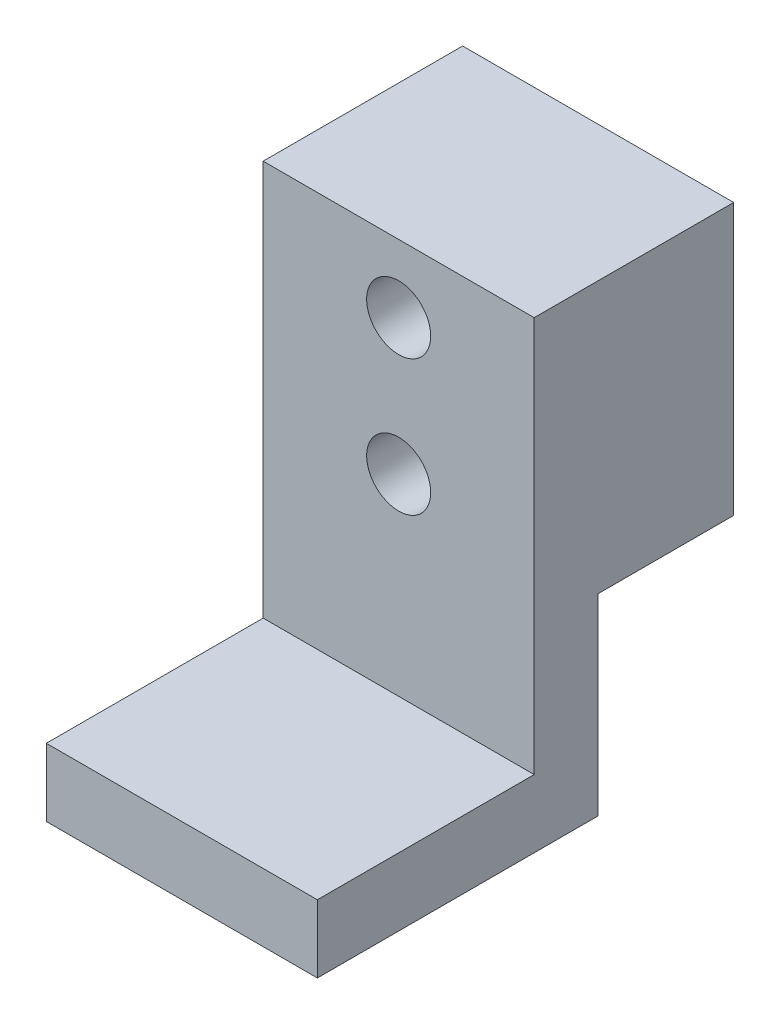
ISO-10303-21;
HEADER;
FILE_DESCRIPTION(('STEP AP214'),'2;1');
FILE_NAME('part.step','',(''),(''),'','','');
FILE_SCHEMA(('AUTOMOTIVE_DESIGN { 1 0 10303 214 1 1 1 1 }'));
ENDSEC;
DATA;
#1=APPLICATION_CONTEXT('core data for automotive mechanical design processes');
#2=APPLICATION_PROTOCOL_DEFINITION('international standard','automotive_design',2000,#1);
#3=PRODUCT_CONTEXT('',#1,'mechanical');
#4=PRODUCT('Part','Part','',(#3));
#5=PRODUCT_RELATED_PRODUCT_CATEGORY('part','',(#4));
#6=PRODUCT_DEFINITION_FORMATION('','',#4);
#7=PRODUCT_DEFINITION_CONTEXT('part definition',#1,'design');
#8=PRODUCT_DEFINITION('design','',#6,#7);
#9=PRODUCT_DEFINITION_SHAPE('','',#8);
#10=(LENGTH_UNIT() NAMED_UNIT(*) SI_UNIT(.MILLI.,.METRE.));
#11=(NAMED_UNIT(*) PLANE_ANGLE_UNIT() SI_UNIT($,.RADIAN.));
#12=(NAMED_UNIT(*) SI_UNIT($,.STERADIAN.) SOLID_ANGLE_UNIT());
#13=UNCERTAINTY_MEASURE_WITH_UNIT(LENGTH_MEASURE(1.E-05),#10,'distance_accuracy_value','');
#14=(GEOMETRIC_REPRESENTATION_CONTEXT(3) GLOBAL_UNCERTAINTY_ASSIGNED_CONTEXT((#13)) GLOBAL_UNIT_ASSIGNED_CONTEXT((#10,
#11,#12)) REPRESENTATION_CONTEXT('',''));
#15=CARTESIAN_POINT('',(0.,0.,0.));
#16=DIRECTION('',(0.,0.,1.));
#17=DIRECTION('',(1.,0.,0.));
#18=AXIS2_PLACEMENT_3D('',#15,#16,#17);
#19=CARTESIAN_POINT('',(6.35,12.7,9.3472));
#20=DIRECTION('',(0.,-1.,0.));
#21=DIRECTION('',(0.,0.,-1.));
#22=AXIS2_PLACEMENT_3D('',#19,#20,#21);
#23=PLANE('',#22);
#24=DIRECTION('',(0.,0.,1.));
#25=VECTOR('',#24,1.);
#26=CARTESIAN_POINT('',(-6.35,12.7,9.3472));
#27=LINE('',#26,#25);
#28=CARTESIAN_POINT('',(-6.35,12.7,0.));
#29=VERTEX_POINT('',#28);
#30=CARTESIAN_POINT('',(-6.35,12.7,9.3472));
#31=VERTEX_POINT('',#30);
#32=EDGE_CURVE('E140',#29,#31,#27,.T.);
#33=ORIENTED_EDGE('',*,*,#32,.T.);
#34=DIRECTION('',(-1.,0.,0.));
#35=VECTOR('',#34,1.);
#36=CARTESIAN_POINT('',(6.35,12.7,9.3472));
#37=LINE('',#36,#35);
#38=CARTESIAN_POINT('',(6.35,12.7,9.3472));
#39=VERTEX_POINT('',#38);
#40=EDGE_CURVE('E11',#39,#31,#37,.T.);
#41=ORIENTED_EDGE('',*,*,#40,.F.);
#42=DIRECTION('',(0.,0.,1.));
#43=VECTOR('',#42,1.);
#44=CARTESIAN_POINT('',(6.35,12.7,9.3472));
#45=LINE('',#44,#43);
#46=CARTESIAN_POINT('',(6.35,12.7,0.));
#47=VERTEX_POINT('',#46);
#48=EDGE_CURVE('E163',#47,#39,#45,.T.);
#49=ORIENTED_EDGE('',*,*,#48,.F.);
#50=DIRECTION('',(-1.,0.,0.));
#51=VECTOR('',#50,1.);
#52=CARTESIAN_POINT('',(6.35,12.7,0.));
#53=LINE('',#52,#51);
#54=EDGE_CURVE('E136',#47,#29,#53,.T.);
#55=ORIENTED_EDGE('',*,*,#54,.T.);
#56=EDGE_LOOP('',(#33,#41,#49,#55));
#57=FACE_BOUND('',#56,.T.);
#58=ADVANCED_FACE('F39',(#57),#23,.F.);
#59=CARTESIAN_POINT('',(6.35,-5.842,9.3472));
#60=DIRECTION('',(0.,0.,-1.));
#61=DIRECTION('',(-1.,0.,0.));
#62=AXIS2_PLACEMENT_3D('',#59,#60,#61);
#63=PLANE('',#62);
#64=CARTESIAN_POINT('',(0.,9.525,9.3472));
#65=DIRECTION('',(0.,0.,1.));
#66=DIRECTION('',(1.,0.,0.));
#67=AXIS2_PLACEMENT_3D('',#64,#65,#66);
#68=CIRCLE('',#67,1.5);
#69=CARTESIAN_POINT('',(1.5,9.525,9.3472));
#70=VERTEX_POINT('',#69);
#71=EDGE_CURVE('E215',#70,#70,#68,.T.);
#72=ORIENTED_EDGE('',*,*,#71,.F.);
#73=EDGE_LOOP('',(#72));
#74=FACE_BOUND('',#73,.T.);
#75=CARTESIAN_POINT('',(0.,3.175,9.3472));
#76=DIRECTION('',(0.,0.,1.));
#77=DIRECTION('',(1.,0.,0.));
#78=AXIS2_PLACEMENT_3D('',#75,#76,#77);
#79=CIRCLE('',#78,1.5);
#80=CARTESIAN_POINT('',(1.5,3.175,9.3472));
#81=VERTEX_POINT('',#80);
#82=EDGE_CURVE('E207',#81,#81,#79,.T.);
#83=ORIENTED_EDGE('',*,*,#82,.F.);
#84=EDGE_LOOP('',(#83));
#85=FACE_BOUND('',#84,.T.);
#86=DIRECTION('',(0.,-1.,0.));
#87=VECTOR('',#86,1.);
#88=CARTESIAN_POINT('',(-6.35,-5.842,9.3472));
#89=LINE('',#88,#87);
#90=CARTESIAN_POINT('',(-6.35,-5.842,9.3472));
#91=VERTEX_POINT('',#90);
#92=EDGE_CURVE('E144',#31,#91,#89,.T.);
#93=ORIENTED_EDGE('',*,*,#92,.T.);
#94=DIRECTION('',(-1.,0.,0.));
#95=VECTOR('',#94,1.);
#96=CARTESIAN_POINT('',(6.35,-5.842,9.3472));
#97=LINE('',#96,#95);
#98=CARTESIAN_POINT('',(6.35,-5.842,9.3472));
#99=VERTEX_POINT('',#98);
#100=EDGE_CURVE('E48',#99,#91,#97,.T.);
#101=ORIENTED_EDGE('',*,*,#100,.F.);
#102=DIRECTION('',(0.,-1.,0.));
#103=VECTOR('',#102,1.);
#104=CARTESIAN_POINT('',(6.35,-5.842,9.3472));
#105=LINE('',#104,#103);
#106=EDGE_CURVE('E99',#39,#99,#105,.T.);
#107=ORIENTED_EDGE('',*,*,#106,.F.);
#108=ORIENTED_EDGE('',*,*,#40,.T.);
#109=EDGE_LOOP('',(#93,#101,#107,#108));
#110=FACE_BOUND('',#109,.T.);
#111=ADVANCED_FACE('F233',(#74,#85,#110),#63,.F.);
#112=CARTESIAN_POINT('',(6.35,-5.842,19.5072));
#113=DIRECTION('',(0.,-1.,0.));
#114=DIRECTION('',(0.,0.,-1.));
#115=AXIS2_PLACEMENT_3D('',#112,#113,#114);
#116=PLANE('',#115);
#117=DIRECTION('',(0.,0.,1.));
#118=VECTOR('',#117,1.);
#119=CARTESIAN_POINT('',(-6.35,-5.842,19.5072));
#120=LINE('',#119,#118);
#121=CARTESIAN_POINT('',(-6.35,-5.842,19.5072));
#122=VERTEX_POINT('',#121);
#123=EDGE_CURVE('E148',#91,#122,#120,.T.);
#124=ORIENTED_EDGE('',*,*,#123,.T.);
#125=DIRECTION('',(-1.,0.,0.));
#126=VECTOR('',#125,1.);
#127=CARTESIAN_POINT('',(6.35,-5.842,19.5072));
#128=LINE('',#127,#126);
#129=CARTESIAN_POINT('',(6.35,-5.842,19.5072));
#130=VERTEX_POINT('',#129);
#131=EDGE_CURVE('E174',#130,#122,#128,.T.);
#132=ORIENTED_EDGE('',*,*,#131,.F.);
#133=DIRECTION('',(0.,0.,1.));
#134=VECTOR('',#133,1.);
#135=CARTESIAN_POINT('',(6.35,-5.842,19.5072));
#136=LINE('',#135,#134);
#137=EDGE_CURVE('E184',#99,#130,#136,.T.);
#138=ORIENTED_EDGE('',*,*,#137,.F.);
#139=ORIENTED_EDGE('',*,*,#100,.T.);
#140=EDGE_LOOP('',(#124,#132,#138,#139));
#141=FACE_BOUND('',#140,.T.);
#142=ADVANCED_FACE('F182',(#141),#116,.F.);
#143=CARTESIAN_POINT('',(6.35,-9.017,19.5072));
#144=DIRECTION('',(0.,0.,-1.));
#145=DIRECTION('',(-1.,0.,0.));
#146=AXIS2_PLACEMENT_3D('',#143,#144,#145);
#147=PLANE('',#146);
#148=DIRECTION('',(0.,-1.,0.));
#149=VECTOR('',#148,1.);
#150=CARTESIAN_POINT('',(-6.35,-9.017,19.5072));
#151=LINE('',#150,#149);
#152=CARTESIAN_POINT('',(-6.35,-9.017,19.5072));
#153=VERTEX_POINT('',#152);
#154=EDGE_CURVE('E151',#122,#153,#151,.T.);
#155=ORIENTED_EDGE('',*,*,#154,.T.);
#156=DIRECTION('',(-1.,0.,0.));
#157=VECTOR('',#156,1.);
#158=CARTESIAN_POINT('',(6.35,-9.017,19.5072));
#159=LINE('',#158,#157);
#160=CARTESIAN_POINT('',(6.35,-9.017,19.5072));
#161=VERTEX_POINT('',#160);
#162=EDGE_CURVE('E170',#161,#153,#159,.T.);
#163=ORIENTED_EDGE('',*,*,#162,.F.);
#164=DIRECTION('',(0.,-1.,0.));
#165=VECTOR('',#164,1.);
#166=CARTESIAN_POINT('',(6.35,-9.017,19.5072));
#167=LINE('',#166,#165);
#168=EDGE_CURVE('E197',#130,#161,#167,.T.);
#169=ORIENTED_EDGE('',*,*,#168,.F.);
#170=ORIENTED_EDGE('',*,*,#131,.T.);
#171=EDGE_LOOP('',(#155,#163,#169,#170));
#172=FACE_BOUND('',#171,.T.);
#173=ADVANCED_FACE('F192',(#172),#147,.F.);
#174=CARTESIAN_POINT('',(6.35,-9.017,6.35));
#175=DIRECTION('',(0.,1.,0.));
#176=DIRECTION('',(0.,0.,1.));
#177=AXIS2_PLACEMENT_3D('',#174,#175,#176);
#178=PLANE('',#177);
#179=DIRECTION('',(0.,0.,-1.));
#180=VECTOR('',#179,1.);
#181=CARTESIAN_POINT('',(-6.35,-9.017,6.35));
#182=LINE('',#181,#180);
#183=CARTESIAN_POINT('',(-6.35,-9.017,6.35));
#184=VERTEX_POINT('',#183);
#185=EDGE_CURVE('E154',#153,#184,#182,.T.);
#186=ORIENTED_EDGE('',*,*,#185,.T.);
#187=DIRECTION('',(-1.,0.,0.));
#188=VECTOR('',#187,1.);
#189=CARTESIAN_POINT('',(6.35,-9.017,6.35));
#190=LINE('',#189,#188);
#191=CARTESIAN_POINT('',(6.35,-9.017,6.35));
#192=VERTEX_POINT('',#191);
#193=EDGE_CURVE('E129',#192,#184,#190,.T.);
#194=ORIENTED_EDGE('',*,*,#193,.F.);
#195=DIRECTION('',(0.,0.,-1.));
#196=VECTOR('',#195,1.);
#197=CARTESIAN_POINT('',(6.35,-9.017,6.35));
#198=LINE('',#197,#196);
#199=EDGE_CURVE('E118',#161,#192,#198,.T.);
#200=ORIENTED_EDGE('',*,*,#199,.F.);
#201=ORIENTED_EDGE('',*,*,#162,.T.);
#202=EDGE_LOOP('',(#186,#194,#200,#201));
#203=FACE_BOUND('',#202,.T.);
#204=ADVANCED_FACE('F195',(#203),#178,.F.);
#205=CARTESIAN_POINT('',(6.35,0.,6.35));
#206=DIRECTION('',(0.,0.,1.));
#207=DIRECTION('',(0.,-1.,0.));
#208=AXIS2_PLACEMENT_3D('',#205,#206,#207);
#209=PLANE('',#208);
#210=DIRECTION('',(0.,1.,0.));
#211=VECTOR('',#210,1.);
#212=CARTESIAN_POINT('',(-6.35,0.,6.35));
#213=LINE('',#212,#211);
#214=CARTESIAN_POINT('',(-6.35,0.,6.35));
#215=VERTEX_POINT('',#214);
#216=EDGE_CURVE('E127',#184,#215,#213,.T.);
#217=ORIENTED_EDGE('',*,*,#216,.T.);
#218=DIRECTION('',(-1.,0.,0.));
#219=VECTOR('',#218,1.);
#220=CARTESIAN_POINT('',(6.35,0.,6.35));
#221=LINE('',#220,#219);
#222=CARTESIAN_POINT('',(6.35,0.,6.35));
#223=VERTEX_POINT('',#222);
#224=EDGE_CURVE('E124',#223,#215,#221,.T.);
#225=ORIENTED_EDGE('',*,*,#224,.F.);
#226=DIRECTION('',(0.,1.,0.));
#227=VECTOR('',#226,1.);
#228=CARTESIAN_POINT('',(6.35,0.,6.35));
#229=LINE('',#228,#227);
#230=EDGE_CURVE('E112',#192,#223,#229,.T.);
#231=ORIENTED_EDGE('',*,*,#230,.F.);
#232=ORIENTED_EDGE('',*,*,#193,.T.);
#233=EDGE_LOOP('',(#217,#225,#231,#232));
#234=FACE_BOUND('',#233,.T.);
#235=ADVANCED_FACE('F125',(#234),#209,.F.);
#236=CARTESIAN_POINT('',(6.35,0.,0.));
#237=DIRECTION('',(0.,1.,0.));
#238=DIRECTION('',(0.,0.,1.));
#239=AXIS2_PLACEMENT_3D('',#236,#237,#238);
#240=PLANE('',#239);
#241=DIRECTION('',(0.,0.,-1.));
#242=VECTOR('',#241,1.);
#243=CARTESIAN_POINT('',(-6.35,0.,0.));
#244=LINE('',#243,#242);
#245=CARTESIAN_POINT('',(-6.35,0.,0.));
#246=VERTEX_POINT('',#245);
#247=EDGE_CURVE('E85',#215,#246,#244,.T.);
#248=ORIENTED_EDGE('',*,*,#247,.T.);
#249=DIRECTION('',(-1.,0.,0.));
#250=VECTOR('',#249,1.);
#251=CARTESIAN_POINT('',(6.35,0.,0.));
#252=LINE('',#251,#250);
#253=CARTESIAN_POINT('',(6.35,0.,0.));
#254=VERTEX_POINT('',#253);
#255=EDGE_CURVE('E130',#254,#246,#252,.T.);
#256=ORIENTED_EDGE('',*,*,#255,.F.);
#257=DIRECTION('',(0.,0.,-1.));
#258=VECTOR('',#257,1.);
#259=CARTESIAN_POINT('',(6.35,0.,0.));
#260=LINE('',#259,#258);
#261=EDGE_CURVE('E116',#223,#254,#260,.T.);
#262=ORIENTED_EDGE('',*,*,#261,.F.);
#263=ORIENTED_EDGE('',*,*,#224,.T.);
#264=EDGE_LOOP('',(#248,#256,#262,#263));
#265=FACE_BOUND('',#264,.T.);
#266=ADVANCED_FACE('F132',(#265),#240,.F.);
#267=CARTESIAN_POINT('',(6.35,12.7,0.));
#268=DIRECTION('',(0.,0.,1.));
#269=DIRECTION('',(0.,-1.,0.));
#270=AXIS2_PLACEMENT_3D('',#267,#268,#269);
#271=PLANE('',#270);
#272=CARTESIAN_POINT('',(0.,9.525,0.));
#273=DIRECTION('',(0.,0.,1.));
#274=DIRECTION('',(1.,0.,0.));
#275=AXIS2_PLACEMENT_3D('',#272,#273,#274);
#276=CIRCLE('',#275,1.5);
#277=CARTESIAN_POINT('',(1.5,9.525,0.));
#278=VERTEX_POINT('',#277);
#279=EDGE_CURVE('E145',#278,#278,#276,.T.);
#280=ORIENTED_EDGE('',*,*,#279,.T.);
#281=EDGE_LOOP('',(#280));
#282=FACE_BOUND('',#281,.T.);
#283=CARTESIAN_POINT('',(0.,3.175,0.));
#284=DIRECTION('',(0.,0.,1.));
#285=DIRECTION('',(1.,0.,0.));
#286=AXIS2_PLACEMENT_3D('',#283,#284,#285);
#287=CIRCLE('',#286,1.5);
#288=CARTESIAN_POINT('',(1.5,3.175,0.));
#289=VERTEX_POINT('',#288);
#290=EDGE_CURVE('E211',#289,#289,#287,.T.);
#291=ORIENTED_EDGE('',*,*,#290,.T.);
#292=EDGE_LOOP('',(#291));
#293=FACE_BOUND('',#292,.T.);
#294=DIRECTION('',(0.,1.,0.));
#295=VECTOR('',#294,1.);
#296=CARTESIAN_POINT('',(-6.35,12.7,0.));
#297=LINE('',#296,#295);
#298=EDGE_CURVE('E91',#246,#29,#297,.T.);
#299=ORIENTED_EDGE('',*,*,#298,.T.);
#300=ORIENTED_EDGE('',*,*,#54,.F.);
#301=DIRECTION('',(0.,1.,0.));
#302=VECTOR('',#301,1.);
#303=CARTESIAN_POINT('',(6.35,12.7,0.));
#304=LINE('',#303,#302);
#305=EDGE_CURVE('E56',#254,#47,#304,.T.);
#306=ORIENTED_EDGE('',*,*,#305,.F.);
#307=ORIENTED_EDGE('',*,*,#255,.T.);
#308=EDGE_LOOP('',(#299,#300,#306,#307));
#309=FACE_BOUND('',#308,.T.);
#310=ADVANCED_FACE('F223',(#282,#293,#309),#271,.F.);
#311=CARTESIAN_POINT('',(6.35,0.,0.));
#312=DIRECTION('',(-1.,0.,0.));
#313=DIRECTION('',(0.,0.,1.));
#314=AXIS2_PLACEMENT_3D('',#311,#312,#313);
#315=PLANE('',#314);
#316=ORIENTED_EDGE('',*,*,#48,.T.);
#317=ORIENTED_EDGE('',*,*,#106,.T.);
#318=ORIENTED_EDGE('',*,*,#137,.T.);
#319=ORIENTED_EDGE('',*,*,#168,.T.);
#320=ORIENTED_EDGE('',*,*,#199,.T.);
#321=ORIENTED_EDGE('',*,*,#230,.T.);
#322=ORIENTED_EDGE('',*,*,#261,.T.);
#323=ORIENTED_EDGE('',*,*,#305,.T.);
#324=EDGE_LOOP('',(#316,#317,#318,#319,#320,#321,#322,#323));
#325=FACE_BOUND('',#324,.T.);
#326=ADVANCED_FACE('F114',(#325),#315,.F.);
#327=CARTESIAN_POINT('',(-6.35,0.,0.));
#328=DIRECTION('',(-1.,0.,0.));
#329=DIRECTION('',(0.,0.,1.));
#330=AXIS2_PLACEMENT_3D('',#327,#328,#329);
#331=PLANE('',#330);
#332=ORIENTED_EDGE('',*,*,#32,.F.);
#333=ORIENTED_EDGE('',*,*,#298,.F.);
#334=ORIENTED_EDGE('',*,*,#247,.F.);
#335=ORIENTED_EDGE('',*,*,#216,.F.);
#336=ORIENTED_EDGE('',*,*,#185,.F.);
#337=ORIENTED_EDGE('',*,*,#154,.F.);
#338=ORIENTED_EDGE('',*,*,#123,.F.);
#339=ORIENTED_EDGE('',*,*,#92,.F.);
#340=EDGE_LOOP('',(#332,#333,#334,#335,#336,#337,#338,#339));
#341=FACE_BOUND('',#340,.T.);
#342=ADVANCED_FACE('F188',(#341),#331,.T.);
#343=CARTESIAN_POINT('',(0.,3.175,0.));
#344=DIRECTION('',(0.,0.,1.));
#345=DIRECTION('',(1.,0.,0.));
#346=AXIS2_PLACEMENT_3D('',#343,#344,#345);
#347=CYLINDRICAL_SURFACE('',#346,1.5);
#348=ORIENTED_EDGE('',*,*,#290,.F.);
#349=EDGE_LOOP('',(#348));
#350=FACE_BOUND('',#349,.T.);
#351=ORIENTED_EDGE('',*,*,#82,.T.);
#352=EDGE_LOOP('',(#351));
#353=FACE_BOUND('',#352,.T.);
#354=ADVANCED_FACE('F229',(#350,#353),#347,.F.);
#355=CARTESIAN_POINT('',(0.,9.525,0.));
#356=DIRECTION('',(0.,0.,1.));
#357=DIRECTION('',(1.,0.,0.));
#358=AXIS2_PLACEMENT_3D('',#355,#356,#357);
#359=CYLINDRICAL_SURFACE('',#358,1.5);
#360=ORIENTED_EDGE('',*,*,#279,.F.);
#361=EDGE_LOOP('',(#360));
#362=FACE_BOUND('',#361,.T.);
#363=ORIENTED_EDGE('',*,*,#71,.T.);
#364=EDGE_LOOP('',(#363));
#365=FACE_BOUND('',#364,.T.);
#366=ADVANCED_FACE('F226',(#362,#365),#359,.F.);
#367=CLOSED_SHELL('',(#58,#111,#142,#173,#204,#235,#266,#310,#326,#342,#354,#366));
#368=MANIFOLD_SOLID_BREP('B2',#367);
#369=ADVANCED_BREP_SHAPE_REPRESENTATION('',(#18,#368),#14);
#370=SHAPE_DEFINITION_REPRESENTATION(#9,#369);
ENDSEC;
END-ISO-10303-21;
